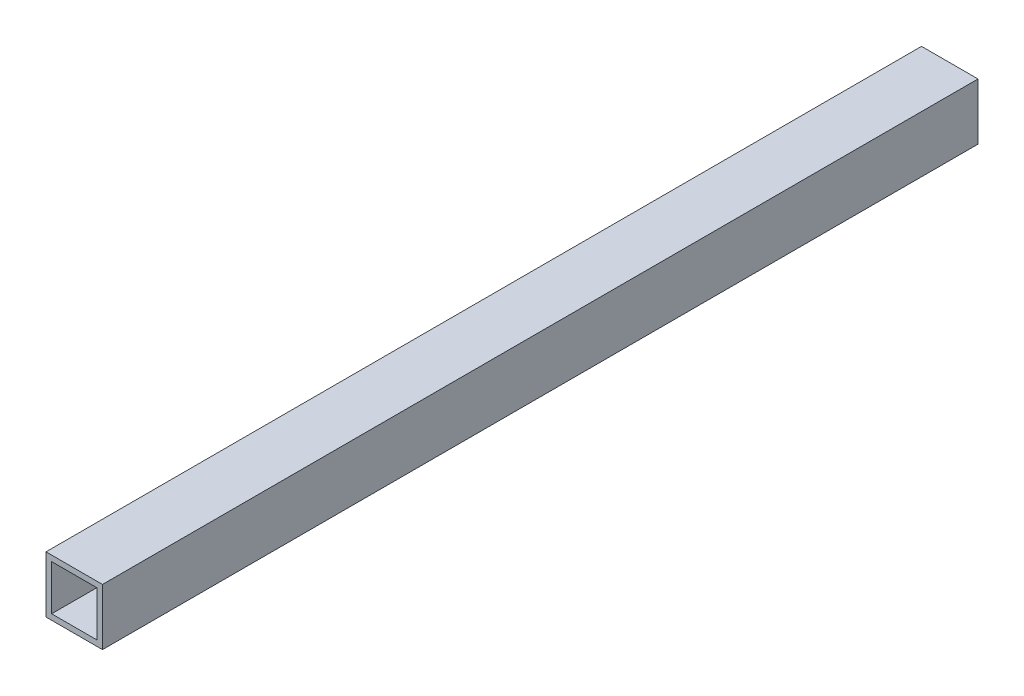
ISO-10303-21;
HEADER;
FILE_DESCRIPTION(('STEP AP214'),'2;1');
FILE_NAME('part.step','',(''),(''),'','','');
FILE_SCHEMA(('AUTOMOTIVE_DESIGN { 1 0 10303 214 1 1 1 1 }'));
ENDSEC;
DATA;
#1=APPLICATION_CONTEXT('core data for automotive mechanical design processes');
#2=APPLICATION_PROTOCOL_DEFINITION('international standard','automotive_design',2000,#1);
#3=PRODUCT_CONTEXT('',#1,'mechanical');
#4=PRODUCT('Part','Part','',(#3));
#5=PRODUCT_RELATED_PRODUCT_CATEGORY('part','',(#4));
#6=PRODUCT_DEFINITION_FORMATION('','',#4);
#7=PRODUCT_DEFINITION_CONTEXT('part definition',#1,'design');
#8=PRODUCT_DEFINITION('design','',#6,#7);
#9=PRODUCT_DEFINITION_SHAPE('','',#8);
#10=(LENGTH_UNIT() NAMED_UNIT(*) SI_UNIT(.MILLI.,.METRE.));
#11=(NAMED_UNIT(*) PLANE_ANGLE_UNIT() SI_UNIT($,.RADIAN.));
#12=(NAMED_UNIT(*) SI_UNIT($,.STERADIAN.) SOLID_ANGLE_UNIT());
#13=UNCERTAINTY_MEASURE_WITH_UNIT(LENGTH_MEASURE(1.E-05),#10,'distance_accuracy_value','');
#14=(GEOMETRIC_REPRESENTATION_CONTEXT(3) GLOBAL_UNCERTAINTY_ASSIGNED_CONTEXT((#13)) GLOBAL_UNIT_ASSIGNED_CONTEXT((#10,
#11,#12)) REPRESENTATION_CONTEXT('',''));
#15=CARTESIAN_POINT('',(0.,0.,0.));
#16=DIRECTION('',(0.,0.,1.));
#17=DIRECTION('',(1.,0.,0.));
#18=AXIS2_PLACEMENT_3D('',#15,#16,#17);
#19=CARTESIAN_POINT('',(-20.,20.,0.));
#20=DIRECTION('',(-1.,0.,0.));
#21=DIRECTION('',(0.,0.,1.));
#22=AXIS2_PLACEMENT_3D('',#19,#20,#21);
#23=PLANE('',#22);
#24=DIRECTION('',(0.,0.,1.));
#25=VECTOR('',#24,1.);
#26=CARTESIAN_POINT('',(-20.,-20.,0.));
#27=LINE('',#26,#25);
#28=CARTESIAN_POINT('',(-20.,-20.,0.));
#29=VERTEX_POINT('',#28);
#30=CARTESIAN_POINT('',(-20.,-20.,620.));
#31=VERTEX_POINT('',#30);
#32=EDGE_CURVE('E91',#29,#31,#27,.T.);
#33=ORIENTED_EDGE('',*,*,#32,.T.);
#34=DIRECTION('',(0.,-1.,0.));
#35=VECTOR('',#34,1.);
#36=CARTESIAN_POINT('',(-20.,20.,620.));
#37=LINE('',#36,#35);
#38=CARTESIAN_POINT('',(-20.,20.,620.));
#39=VERTEX_POINT('',#38);
#40=EDGE_CURVE('E113',#39,#31,#37,.T.);
#41=ORIENTED_EDGE('',*,*,#40,.F.);
#42=DIRECTION('',(0.,0.,1.));
#43=VECTOR('',#42,1.);
#44=CARTESIAN_POINT('',(-20.,20.,0.));
#45=LINE('',#44,#43);
#46=CARTESIAN_POINT('',(-20.,20.,0.));
#47=VERTEX_POINT('',#46);
#48=EDGE_CURVE('E94',#47,#39,#45,.T.);
#49=ORIENTED_EDGE('',*,*,#48,.F.);
#50=DIRECTION('',(0.,-1.,0.));
#51=VECTOR('',#50,1.);
#52=CARTESIAN_POINT('',(-20.,20.,0.));
#53=LINE('',#52,#51);
#54=EDGE_CURVE('E90',#47,#29,#53,.T.);
#55=ORIENTED_EDGE('',*,*,#54,.T.);
#56=EDGE_LOOP('',(#33,#41,#49,#55));
#57=FACE_BOUND('',#56,.T.);
#58=ADVANCED_FACE('F34',(#57),#23,.T.);
#59=CARTESIAN_POINT('',(-20.,-20.,0.));
#60=DIRECTION('',(0.,-1.,0.));
#61=DIRECTION('',(0.,0.,-1.));
#62=AXIS2_PLACEMENT_3D('',#59,#60,#61);
#63=PLANE('',#62);
#64=DIRECTION('',(0.,0.,1.));
#65=VECTOR('',#64,1.);
#66=CARTESIAN_POINT('',(20.,-20.,0.));
#67=LINE('',#66,#65);
#68=CARTESIAN_POINT('',(20.,-20.,0.));
#69=VERTEX_POINT('',#68);
#70=CARTESIAN_POINT('',(20.,-20.,620.));
#71=VERTEX_POINT('',#70);
#72=EDGE_CURVE('E101',#69,#71,#67,.T.);
#73=ORIENTED_EDGE('',*,*,#72,.T.);
#74=DIRECTION('',(1.,0.,0.));
#75=VECTOR('',#74,1.);
#76=CARTESIAN_POINT('',(-20.,-20.,620.));
#77=LINE('',#76,#75);
#78=EDGE_CURVE('E100',#31,#71,#77,.T.);
#79=ORIENTED_EDGE('',*,*,#78,.F.);
#80=ORIENTED_EDGE('',*,*,#32,.F.);
#81=DIRECTION('',(1.,0.,0.));
#82=VECTOR('',#81,1.);
#83=CARTESIAN_POINT('',(-20.,-20.,0.));
#84=LINE('',#83,#82);
#85=EDGE_CURVE('E83',#29,#69,#84,.T.);
#86=ORIENTED_EDGE('',*,*,#85,.T.);
#87=EDGE_LOOP('',(#73,#79,#80,#86));
#88=FACE_BOUND('',#87,.T.);
#89=ADVANCED_FACE('F98',(#88),#63,.T.);
#90=CARTESIAN_POINT('',(20.,20.,0.));
#91=DIRECTION('',(1.,0.,0.));
#92=DIRECTION('',(0.,0.,-1.));
#93=AXIS2_PLACEMENT_3D('',#90,#91,#92);
#94=PLANE('',#93);
#95=DIRECTION('',(0.,0.,1.));
#96=VECTOR('',#95,1.);
#97=CARTESIAN_POINT('',(20.,20.,0.));
#98=LINE('',#97,#96);
#99=CARTESIAN_POINT('',(20.,20.,0.));
#100=VERTEX_POINT('',#99);
#101=CARTESIAN_POINT('',(20.,20.,620.));
#102=VERTEX_POINT('',#101);
#103=EDGE_CURVE('E38',#100,#102,#98,.T.);
#104=ORIENTED_EDGE('',*,*,#103,.T.);
#105=DIRECTION('',(0.,1.,0.));
#106=VECTOR('',#105,1.);
#107=CARTESIAN_POINT('',(20.,20.,620.));
#108=LINE('',#107,#106);
#109=EDGE_CURVE('E110',#71,#102,#108,.T.);
#110=ORIENTED_EDGE('',*,*,#109,.F.);
#111=ORIENTED_EDGE('',*,*,#72,.F.);
#112=DIRECTION('',(0.,1.,0.));
#113=VECTOR('',#112,1.);
#114=CARTESIAN_POINT('',(20.,20.,0.));
#115=LINE('',#114,#113);
#116=EDGE_CURVE('E105',#69,#100,#115,.T.);
#117=ORIENTED_EDGE('',*,*,#116,.T.);
#118=EDGE_LOOP('',(#104,#110,#111,#117));
#119=FACE_BOUND('',#118,.T.);
#120=ADVANCED_FACE('F119',(#119),#94,.T.);
#121=CARTESIAN_POINT('',(-20.,20.,0.));
#122=DIRECTION('',(0.,1.,0.));
#123=DIRECTION('',(0.,0.,1.));
#124=AXIS2_PLACEMENT_3D('',#121,#122,#123);
#125=PLANE('',#124);
#126=DIRECTION('',(-1.,0.,0.));
#127=VECTOR('',#126,1.);
#128=CARTESIAN_POINT('',(-20.,20.,620.));
#129=LINE('',#128,#127);
#130=EDGE_CURVE('E124',#102,#39,#129,.T.);
#131=ORIENTED_EDGE('',*,*,#130,.F.);
#132=ORIENTED_EDGE('',*,*,#103,.F.);
#133=DIRECTION('',(-1.,0.,0.));
#134=VECTOR('',#133,1.);
#135=CARTESIAN_POINT('',(-20.,20.,0.));
#136=LINE('',#135,#134);
#137=EDGE_CURVE('E107',#100,#47,#136,.T.);
#138=ORIENTED_EDGE('',*,*,#137,.T.);
#139=ORIENTED_EDGE('',*,*,#48,.T.);
#140=EDGE_LOOP('',(#131,#132,#138,#139));
#141=FACE_BOUND('',#140,.T.);
#142=ADVANCED_FACE('F36',(#141),#125,.T.);
#143=CARTESIAN_POINT('',(0.,0.,0.));
#144=DIRECTION('',(0.,0.,1.));
#145=DIRECTION('',(1.,0.,0.));
#146=AXIS2_PLACEMENT_3D('',#143,#144,#145);
#147=PLANE('',#146);
#148=DIRECTION('',(0.,-1.,0.));
#149=VECTOR('',#148,1.);
#150=CARTESIAN_POINT('',(-16.,16.,0.));
#151=LINE('',#150,#149);
#152=CARTESIAN_POINT('',(-16.,-16.,0.));
#153=VERTEX_POINT('',#152);
#154=CARTESIAN_POINT('',(-16.,16.,0.));
#155=VERTEX_POINT('',#154);
#156=EDGE_CURVE('E129',#153,#155,#151,.F.);
#157=ORIENTED_EDGE('',*,*,#156,.F.);
#158=DIRECTION('',(1.,0.,0.));
#159=VECTOR('',#158,1.);
#160=CARTESIAN_POINT('',(-16.,-16.,0.));
#161=LINE('',#160,#159);
#162=CARTESIAN_POINT('',(16.,-16.,0.));
#163=VERTEX_POINT('',#162);
#164=EDGE_CURVE('E133',#163,#153,#161,.F.);
#165=ORIENTED_EDGE('',*,*,#164,.F.);
#166=DIRECTION('',(0.,1.,0.));
#167=VECTOR('',#166,1.);
#168=CARTESIAN_POINT('',(16.,16.,0.));
#169=LINE('',#168,#167);
#170=CARTESIAN_POINT('',(16.,16.,0.));
#171=VERTEX_POINT('',#170);
#172=EDGE_CURVE('E140',#171,#163,#169,.F.);
#173=ORIENTED_EDGE('',*,*,#172,.F.);
#174=DIRECTION('',(-1.,0.,0.));
#175=VECTOR('',#174,1.);
#176=CARTESIAN_POINT('',(-16.,16.,0.));
#177=LINE('',#176,#175);
#178=EDGE_CURVE('E125',#155,#171,#177,.F.);
#179=ORIENTED_EDGE('',*,*,#178,.F.);
#180=EDGE_LOOP('',(#157,#165,#173,#179));
#181=FACE_BOUND('',#180,.T.);
#182=ORIENTED_EDGE('',*,*,#54,.F.);
#183=ORIENTED_EDGE('',*,*,#137,.F.);
#184=ORIENTED_EDGE('',*,*,#116,.F.);
#185=ORIENTED_EDGE('',*,*,#85,.F.);
#186=EDGE_LOOP('',(#182,#183,#184,#185));
#187=FACE_BOUND('',#186,.T.);
#188=ADVANCED_FACE('F104',(#181,#187),#147,.F.);
#189=CARTESIAN_POINT('',(0.,0.,620.));
#190=DIRECTION('',(0.,0.,1.));
#191=DIRECTION('',(1.,0.,0.));
#192=AXIS2_PLACEMENT_3D('',#189,#190,#191);
#193=PLANE('',#192);
#194=DIRECTION('',(0.,-1.,0.));
#195=VECTOR('',#194,1.);
#196=CARTESIAN_POINT('',(-16.,16.,620.));
#197=LINE('',#196,#195);
#198=CARTESIAN_POINT('',(-16.,-16.,620.));
#199=VERTEX_POINT('',#198);
#200=CARTESIAN_POINT('',(-16.,16.,620.));
#201=VERTEX_POINT('',#200);
#202=EDGE_CURVE('E11',#199,#201,#197,.F.);
#203=ORIENTED_EDGE('',*,*,#202,.T.);
#204=DIRECTION('',(-1.,0.,0.));
#205=VECTOR('',#204,1.);
#206=CARTESIAN_POINT('',(-16.,16.,620.));
#207=LINE('',#206,#205);
#208=CARTESIAN_POINT('',(16.,16.,620.));
#209=VERTEX_POINT('',#208);
#210=EDGE_CURVE('E150',#201,#209,#207,.F.);
#211=ORIENTED_EDGE('',*,*,#210,.T.);
#212=DIRECTION('',(0.,1.,0.));
#213=VECTOR('',#212,1.);
#214=CARTESIAN_POINT('',(16.,16.,620.));
#215=LINE('',#214,#213);
#216=CARTESIAN_POINT('',(16.,-16.,620.));
#217=VERTEX_POINT('',#216);
#218=EDGE_CURVE('E143',#209,#217,#215,.F.);
#219=ORIENTED_EDGE('',*,*,#218,.T.);
#220=DIRECTION('',(1.,0.,0.));
#221=VECTOR('',#220,1.);
#222=CARTESIAN_POINT('',(-16.,-16.,620.));
#223=LINE('',#222,#221);
#224=EDGE_CURVE('E52',#217,#199,#223,.F.);
#225=ORIENTED_EDGE('',*,*,#224,.T.);
#226=EDGE_LOOP('',(#203,#211,#219,#225));
#227=FACE_BOUND('',#226,.T.);
#228=ORIENTED_EDGE('',*,*,#40,.T.);
#229=ORIENTED_EDGE('',*,*,#78,.T.);
#230=ORIENTED_EDGE('',*,*,#109,.T.);
#231=ORIENTED_EDGE('',*,*,#130,.T.);
#232=EDGE_LOOP('',(#228,#229,#230,#231));
#233=FACE_BOUND('',#232,.T.);
#234=ADVANCED_FACE('F123',(#227,#233),#193,.T.);
#235=CARTESIAN_POINT('',(-16.,16.,0.));
#236=DIRECTION('',(0.,-1.,0.));
#237=DIRECTION('',(0.,0.,-1.));
#238=AXIS2_PLACEMENT_3D('',#235,#236,#237);
#239=PLANE('',#238);
#240=DIRECTION('',(0.,0.,1.));
#241=VECTOR('',#240,1.);
#242=CARTESIAN_POINT('',(16.,16.,0.));
#243=LINE('',#242,#241);
#244=EDGE_CURVE('E145',#171,#209,#243,.T.);
#245=ORIENTED_EDGE('',*,*,#244,.T.);
#246=ORIENTED_EDGE('',*,*,#210,.F.);
#247=DIRECTION('',(0.,0.,1.));
#248=VECTOR('',#247,1.);
#249=CARTESIAN_POINT('',(-16.,16.,0.));
#250=LINE('',#249,#248);
#251=EDGE_CURVE('E132',#155,#201,#250,.T.);
#252=ORIENTED_EDGE('',*,*,#251,.F.);
#253=ORIENTED_EDGE('',*,*,#178,.T.);
#254=EDGE_LOOP('',(#245,#246,#252,#253));
#255=FACE_BOUND('',#254,.T.);
#256=ADVANCED_FACE('F161',(#255),#239,.T.);
#257=CARTESIAN_POINT('',(16.,16.,0.));
#258=DIRECTION('',(-1.,0.,0.));
#259=DIRECTION('',(0.,0.,1.));
#260=AXIS2_PLACEMENT_3D('',#257,#258,#259);
#261=PLANE('',#260);
#262=DIRECTION('',(0.,0.,1.));
#263=VECTOR('',#262,1.);
#264=CARTESIAN_POINT('',(16.,-16.,0.));
#265=LINE('',#264,#263);
#266=EDGE_CURVE('E137',#163,#217,#265,.T.);
#267=ORIENTED_EDGE('',*,*,#266,.T.);
#268=ORIENTED_EDGE('',*,*,#218,.F.);
#269=ORIENTED_EDGE('',*,*,#244,.F.);
#270=ORIENTED_EDGE('',*,*,#172,.T.);
#271=EDGE_LOOP('',(#267,#268,#269,#270));
#272=FACE_BOUND('',#271,.T.);
#273=ADVANCED_FACE('F170',(#272),#261,.T.);
#274=CARTESIAN_POINT('',(-16.,-16.,0.));
#275=DIRECTION('',(0.,1.,0.));
#276=DIRECTION('',(0.,0.,1.));
#277=AXIS2_PLACEMENT_3D('',#274,#275,#276);
#278=PLANE('',#277);
#279=DIRECTION('',(0.,0.,1.));
#280=VECTOR('',#279,1.);
#281=CARTESIAN_POINT('',(-16.,-16.,0.));
#282=LINE('',#281,#280);
#283=EDGE_CURVE('E44',#153,#199,#282,.T.);
#284=ORIENTED_EDGE('',*,*,#283,.T.);
#285=ORIENTED_EDGE('',*,*,#224,.F.);
#286=ORIENTED_EDGE('',*,*,#266,.F.);
#287=ORIENTED_EDGE('',*,*,#164,.T.);
#288=EDGE_LOOP('',(#284,#285,#286,#287));
#289=FACE_BOUND('',#288,.T.);
#290=ADVANCED_FACE('F175',(#289),#278,.T.);
#291=CARTESIAN_POINT('',(-16.,16.,0.));
#292=DIRECTION('',(1.,0.,0.));
#293=DIRECTION('',(0.,0.,-1.));
#294=AXIS2_PLACEMENT_3D('',#291,#292,#293);
#295=PLANE('',#294);
#296=ORIENTED_EDGE('',*,*,#202,.F.);
#297=ORIENTED_EDGE('',*,*,#283,.F.);
#298=ORIENTED_EDGE('',*,*,#156,.T.);
#299=ORIENTED_EDGE('',*,*,#251,.T.);
#300=EDGE_LOOP('',(#296,#297,#298,#299));
#301=FACE_BOUND('',#300,.T.);
#302=ADVANCED_FACE('F179',(#301),#295,.T.);
#303=CLOSED_SHELL('',(#58,#89,#120,#142,#188,#234,#256,#273,#290,#302));
#304=MANIFOLD_SOLID_BREP('B2',#303);
#305=ADVANCED_BREP_SHAPE_REPRESENTATION('',(#18,#304),#14);
#306=SHAPE_DEFINITION_REPRESENTATION(#9,#305);
ENDSEC;
END-ISO-10303-21;
